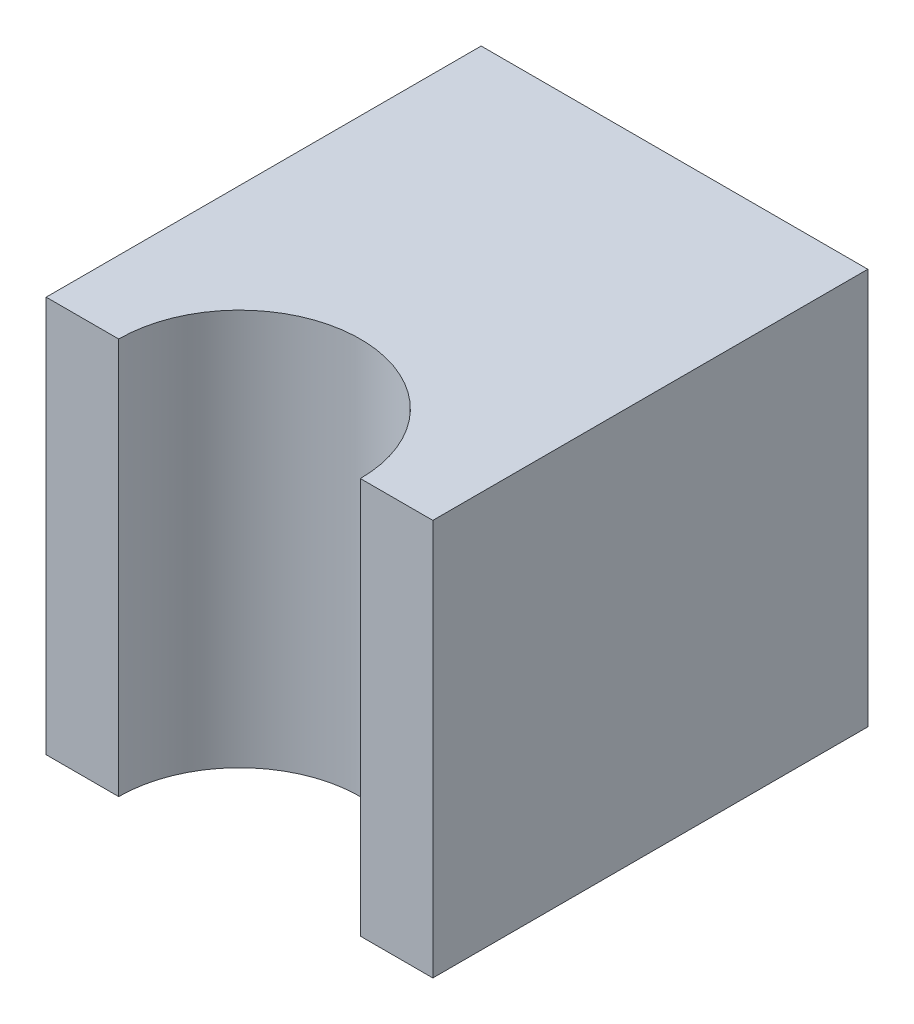
ISO-10303-21;
HEADER;
FILE_DESCRIPTION(('STEP AP214'),'2;1');
FILE_NAME('part.step','',(''),(''),'','','');
FILE_SCHEMA(('AUTOMOTIVE_DESIGN { 1 0 10303 214 1 1 1 1 }'));
ENDSEC;
DATA;
#1=APPLICATION_CONTEXT('core data for automotive mechanical design processes');
#2=APPLICATION_PROTOCOL_DEFINITION('international standard','automotive_design',2000,#1);
#3=PRODUCT_CONTEXT('',#1,'mechanical');
#4=PRODUCT('Part','Part','',(#3));
#5=PRODUCT_RELATED_PRODUCT_CATEGORY('part','',(#4));
#6=PRODUCT_DEFINITION_FORMATION('','',#4);
#7=PRODUCT_DEFINITION_CONTEXT('part definition',#1,'design');
#8=PRODUCT_DEFINITION('design','',#6,#7);
#9=PRODUCT_DEFINITION_SHAPE('','',#8);
#10=(LENGTH_UNIT() NAMED_UNIT(*) SI_UNIT(.MILLI.,.METRE.));
#11=(NAMED_UNIT(*) PLANE_ANGLE_UNIT() SI_UNIT($,.RADIAN.));
#12=(NAMED_UNIT(*) SI_UNIT($,.STERADIAN.) SOLID_ANGLE_UNIT());
#13=UNCERTAINTY_MEASURE_WITH_UNIT(LENGTH_MEASURE(1.E-05),#10,'distance_accuracy_value','');
#14=(GEOMETRIC_REPRESENTATION_CONTEXT(3) GLOBAL_UNCERTAINTY_ASSIGNED_CONTEXT((#13)) GLOBAL_UNIT_ASSIGNED_CONTEXT((#10,
#11,#12)) REPRESENTATION_CONTEXT('',''));
#15=CARTESIAN_POINT('',(0.,0.,0.));
#16=DIRECTION('',(0.,0.,1.));
#17=DIRECTION('',(1.,0.,0.));
#18=AXIS2_PLACEMENT_3D('',#15,#16,#17);
#19=CARTESIAN_POINT('',(3.95,0.,6.1));
#20=DIRECTION('',(0.,0.,1.));
#21=DIRECTION('',(1.,0.,0.));
#22=AXIS2_PLACEMENT_3D('',#19,#20,#21);
#23=PLANE('',#22);
#24=DIRECTION('',(1.,0.,0.));
#25=VECTOR('',#24,1.);
#26=CARTESIAN_POINT('',(3.7,0.82,6.1));
#27=LINE('',#26,#25);
#28=CARTESIAN_POINT('',(3.95,0.82,6.1));
#29=VERTEX_POINT('',#28);
#30=CARTESIAN_POINT('',(4.1,0.82,6.1));
#31=VERTEX_POINT('',#30);
#32=EDGE_CURVE('E76',#29,#31,#27,.T.);
#33=ORIENTED_EDGE('',*,*,#32,.F.);
#34=DIRECTION('',(0.,1.,0.));
#35=VECTOR('',#34,1.);
#36=CARTESIAN_POINT('',(3.95,0.,6.1));
#37=LINE('',#36,#35);
#38=CARTESIAN_POINT('',(3.95,0.,6.1));
#39=VERTEX_POINT('',#38);
#40=EDGE_CURVE('E72',#29,#39,#37,.F.);
#41=ORIENTED_EDGE('',*,*,#40,.T.);
#42=DIRECTION('',(1.,0.,0.));
#43=VECTOR('',#42,1.);
#44=CARTESIAN_POINT('',(3.7,0.,6.1));
#45=LINE('',#44,#43);
#46=CARTESIAN_POINT('',(4.1,0.,6.1));
#47=VERTEX_POINT('',#46);
#48=EDGE_CURVE('E73',#39,#47,#45,.T.);
#49=ORIENTED_EDGE('',*,*,#48,.T.);
#50=DIRECTION('',(0.,1.,0.));
#51=VECTOR('',#50,1.);
#52=CARTESIAN_POINT('',(4.1,0.,6.1));
#53=LINE('',#52,#51);
#54=EDGE_CURVE('E80',#31,#47,#53,.F.);
#55=ORIENTED_EDGE('',*,*,#54,.F.);
#56=EDGE_LOOP('',(#33,#41,#49,#55));
#57=FACE_BOUND('',#56,.T.);
#58=ADVANCED_FACE('F17',(#57),#23,.T.);
#59=CARTESIAN_POINT('',(3.7,0.,6.1));
#60=DIRECTION('',(0.,1.,0.));
#61=DIRECTION('',(0.,0.,1.));
#62=AXIS2_PLACEMENT_3D('',#59,#60,#61);
#63=CYLINDRICAL_SURFACE('',#62,0.25);
#64=ORIENTED_EDGE('',*,*,#40,.F.);
#65=CARTESIAN_POINT('',(3.7,0.82,6.1));
#66=DIRECTION('',(0.,1.,0.));
#67=DIRECTION('',(0.,0.,1.));
#68=AXIS2_PLACEMENT_3D('',#65,#66,#67);
#69=CIRCLE('',#68,0.25);
#70=CARTESIAN_POINT('',(3.45,0.82,6.1));
#71=VERTEX_POINT('',#70);
#72=EDGE_CURVE('E129',#71,#29,#69,.F.);
#73=ORIENTED_EDGE('',*,*,#72,.F.);
#74=DIRECTION('',(0.,1.,0.));
#75=VECTOR('',#74,1.);
#76=CARTESIAN_POINT('',(3.45,0.,6.1));
#77=LINE('',#76,#75);
#78=CARTESIAN_POINT('',(3.45,0.,6.1));
#79=VERTEX_POINT('',#78);
#80=EDGE_CURVE('E83',#79,#71,#77,.T.);
#81=ORIENTED_EDGE('',*,*,#80,.F.);
#82=CARTESIAN_POINT('',(3.7,0.,6.1));
#83=DIRECTION('',(0.,1.,0.));
#84=DIRECTION('',(0.,0.,1.));
#85=AXIS2_PLACEMENT_3D('',#82,#83,#84);
#86=CIRCLE('',#85,0.25);
#87=EDGE_CURVE('E20',#79,#39,#86,.F.);
#88=ORIENTED_EDGE('',*,*,#87,.T.);
#89=EDGE_LOOP('',(#64,#73,#81,#88));
#90=FACE_BOUND('',#89,.T.);
#91=ADVANCED_FACE('F82',(#90),#63,.F.);
#92=CARTESIAN_POINT('',(4.1,0.,6.1));
#93=DIRECTION('',(1.,0.,0.));
#94=DIRECTION('',(0.,0.,-1.));
#95=AXIS2_PLACEMENT_3D('',#92,#93,#94);
#96=PLANE('',#95);
#97=DIRECTION('',(0.,0.,1.));
#98=VECTOR('',#97,1.);
#99=CARTESIAN_POINT('',(4.1,0.82,5.65));
#100=LINE('',#99,#98);
#101=CARTESIAN_POINT('',(4.1,0.82,5.2));
#102=VERTEX_POINT('',#101);
#103=EDGE_CURVE('E108',#31,#102,#100,.F.);
#104=ORIENTED_EDGE('',*,*,#103,.F.);
#105=ORIENTED_EDGE('',*,*,#54,.T.);
#106=DIRECTION('',(0.,0.,1.));
#107=VECTOR('',#106,1.);
#108=CARTESIAN_POINT('',(4.1,0.,5.65));
#109=LINE('',#108,#107);
#110=CARTESIAN_POINT('',(4.1,0.,5.2));
#111=VERTEX_POINT('',#110);
#112=EDGE_CURVE('E85',#47,#111,#109,.F.);
#113=ORIENTED_EDGE('',*,*,#112,.T.);
#114=DIRECTION('',(0.,1.,0.));
#115=VECTOR('',#114,1.);
#116=CARTESIAN_POINT('',(4.1,0.,5.2));
#117=LINE('',#116,#115);
#118=EDGE_CURVE('E120',#102,#111,#117,.F.);
#119=ORIENTED_EDGE('',*,*,#118,.F.);
#120=EDGE_LOOP('',(#104,#105,#113,#119));
#121=FACE_BOUND('',#120,.T.);
#122=ADVANCED_FACE('F144',(#121),#96,.T.);
#123=CARTESIAN_POINT('',(3.7,0.,5.65));
#124=DIRECTION('',(0.,1.,0.));
#125=DIRECTION('',(0.,0.,1.));
#126=AXIS2_PLACEMENT_3D('',#123,#124,#125);
#127=PLANE('',#126);
#128=ORIENTED_EDGE('',*,*,#87,.F.);
#129=DIRECTION('',(1.,0.,0.));
#130=VECTOR('',#129,1.);
#131=CARTESIAN_POINT('',(3.3,0.,6.1));
#132=LINE('',#131,#130);
#133=CARTESIAN_POINT('',(3.3,0.,6.1));
#134=VERTEX_POINT('',#133);
#135=EDGE_CURVE('E88',#134,#79,#132,.T.);
#136=ORIENTED_EDGE('',*,*,#135,.F.);
#137=DIRECTION('',(0.,0.,1.));
#138=VECTOR('',#137,1.);
#139=CARTESIAN_POINT('',(3.3,0.,5.2));
#140=LINE('',#139,#138);
#141=CARTESIAN_POINT('',(3.3,0.,5.2));
#142=VERTEX_POINT('',#141);
#143=EDGE_CURVE('E105',#142,#134,#140,.T.);
#144=ORIENTED_EDGE('',*,*,#143,.F.);
#145=DIRECTION('',(-1.,0.,0.));
#146=VECTOR('',#145,1.);
#147=CARTESIAN_POINT('',(4.1,0.,5.2));
#148=LINE('',#147,#146);
#149=EDGE_CURVE('E126',#111,#142,#148,.T.);
#150=ORIENTED_EDGE('',*,*,#149,.F.);
#151=ORIENTED_EDGE('',*,*,#112,.F.);
#152=ORIENTED_EDGE('',*,*,#48,.F.);
#153=EDGE_LOOP('',(#128,#136,#144,#150,#151,#152));
#154=FACE_BOUND('',#153,.T.);
#155=ADVANCED_FACE('F86',(#154),#127,.F.);
#156=CARTESIAN_POINT('',(3.3,0.,6.1));
#157=DIRECTION('',(0.,0.,1.));
#158=DIRECTION('',(1.,0.,0.));
#159=AXIS2_PLACEMENT_3D('',#156,#157,#158);
#160=PLANE('',#159);
#161=DIRECTION('',(1.,0.,0.));
#162=VECTOR('',#161,1.);
#163=CARTESIAN_POINT('',(3.7,0.82,6.1));
#164=LINE('',#163,#162);
#165=CARTESIAN_POINT('',(3.3,0.82,6.1));
#166=VERTEX_POINT('',#165);
#167=EDGE_CURVE('E110',#166,#71,#164,.T.);
#168=ORIENTED_EDGE('',*,*,#167,.F.);
#169=DIRECTION('',(0.,1.,0.));
#170=VECTOR('',#169,1.);
#171=CARTESIAN_POINT('',(3.3,0.,6.1));
#172=LINE('',#171,#170);
#173=EDGE_CURVE('E100',#134,#166,#172,.T.);
#174=ORIENTED_EDGE('',*,*,#173,.F.);
#175=ORIENTED_EDGE('',*,*,#135,.T.);
#176=ORIENTED_EDGE('',*,*,#80,.T.);
#177=EDGE_LOOP('',(#168,#174,#175,#176));
#178=FACE_BOUND('',#177,.T.);
#179=ADVANCED_FACE('F151',(#178),#160,.T.);
#180=CARTESIAN_POINT('',(3.7,0.82,5.65));
#181=DIRECTION('',(0.,1.,0.));
#182=DIRECTION('',(0.,0.,1.));
#183=AXIS2_PLACEMENT_3D('',#180,#181,#182);
#184=PLANE('',#183);
#185=ORIENTED_EDGE('',*,*,#167,.T.);
#186=ORIENTED_EDGE('',*,*,#72,.T.);
#187=ORIENTED_EDGE('',*,*,#32,.T.);
#188=ORIENTED_EDGE('',*,*,#103,.T.);
#189=DIRECTION('',(-1.,0.,0.));
#190=VECTOR('',#189,1.);
#191=CARTESIAN_POINT('',(4.1,0.82,5.2));
#192=LINE('',#191,#190);
#193=CARTESIAN_POINT('',(3.3,0.82,5.2));
#194=VERTEX_POINT('',#193);
#195=EDGE_CURVE('E35',#194,#102,#192,.F.);
#196=ORIENTED_EDGE('',*,*,#195,.F.);
#197=DIRECTION('',(0.,0.,1.));
#198=VECTOR('',#197,1.);
#199=CARTESIAN_POINT('',(3.3,0.82,5.2));
#200=LINE('',#199,#198);
#201=EDGE_CURVE('E26',#166,#194,#200,.F.);
#202=ORIENTED_EDGE('',*,*,#201,.F.);
#203=EDGE_LOOP('',(#185,#186,#187,#188,#196,#202));
#204=FACE_BOUND('',#203,.T.);
#205=ADVANCED_FACE('F140',(#204),#184,.T.);
#206=CARTESIAN_POINT('',(4.1,0.,5.2));
#207=DIRECTION('',(0.,0.,-1.));
#208=DIRECTION('',(-1.,0.,0.));
#209=AXIS2_PLACEMENT_3D('',#206,#207,#208);
#210=PLANE('',#209);
#211=ORIENTED_EDGE('',*,*,#195,.T.);
#212=ORIENTED_EDGE('',*,*,#118,.T.);
#213=ORIENTED_EDGE('',*,*,#149,.T.);
#214=DIRECTION('',(0.,1.,0.));
#215=VECTOR('',#214,1.);
#216=CARTESIAN_POINT('',(3.3,0.,5.2));
#217=LINE('',#216,#215);
#218=EDGE_CURVE('E11',#194,#142,#217,.F.);
#219=ORIENTED_EDGE('',*,*,#218,.F.);
#220=EDGE_LOOP('',(#211,#212,#213,#219));
#221=FACE_BOUND('',#220,.T.);
#222=ADVANCED_FACE('F146',(#221),#210,.T.);
#223=CARTESIAN_POINT('',(3.3,0.,5.2));
#224=DIRECTION('',(-1.,0.,0.));
#225=DIRECTION('',(0.,0.,1.));
#226=AXIS2_PLACEMENT_3D('',#223,#224,#225);
#227=PLANE('',#226);
#228=ORIENTED_EDGE('',*,*,#201,.T.);
#229=ORIENTED_EDGE('',*,*,#218,.T.);
#230=ORIENTED_EDGE('',*,*,#143,.T.);
#231=ORIENTED_EDGE('',*,*,#173,.T.);
#232=EDGE_LOOP('',(#228,#229,#230,#231));
#233=FACE_BOUND('',#232,.T.);
#234=ADVANCED_FACE('F148',(#233),#227,.T.);
#235=CLOSED_SHELL('',(#58,#91,#122,#155,#179,#205,#222,#234));
#236=MANIFOLD_SOLID_BREP('B1',#235);
#237=ADVANCED_BREP_SHAPE_REPRESENTATION('',(#18,#236),#14);
#238=SHAPE_DEFINITION_REPRESENTATION(#9,#237);
ENDSEC;
END-ISO-10303-21;
